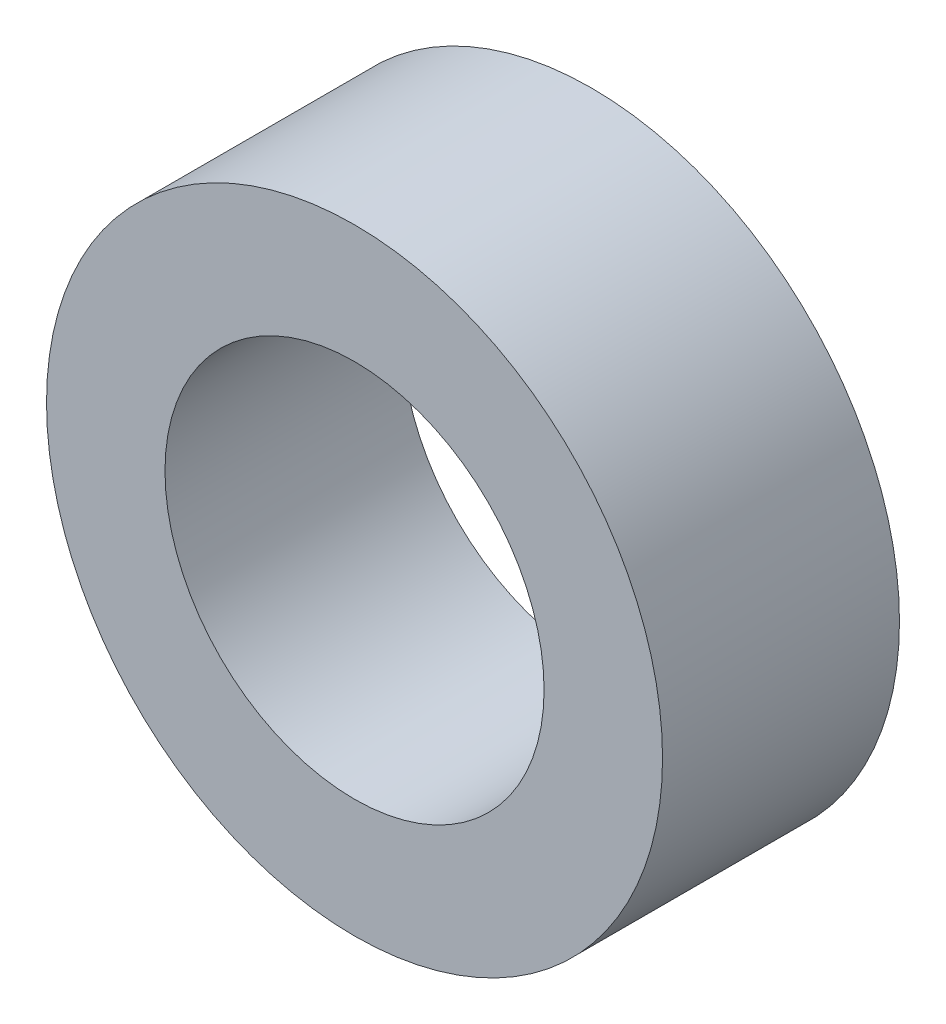
ISO-10303-21;
HEADER;
FILE_DESCRIPTION(('STEP AP214'),'2;1');
FILE_NAME('part.step','',(''),(''),'','','');
FILE_SCHEMA(('AUTOMOTIVE_DESIGN { 1 0 10303 214 1 1 1 1 }'));
ENDSEC;
DATA;
#1=APPLICATION_CONTEXT('core data for automotive mechanical design processes');
#2=APPLICATION_PROTOCOL_DEFINITION('international standard','automotive_design',2000,#1);
#3=PRODUCT_CONTEXT('',#1,'mechanical');
#4=PRODUCT('Part','Part','',(#3));
#5=PRODUCT_RELATED_PRODUCT_CATEGORY('part','',(#4));
#6=PRODUCT_DEFINITION_FORMATION('','',#4);
#7=PRODUCT_DEFINITION_CONTEXT('part definition',#1,'design');
#8=PRODUCT_DEFINITION('design','',#6,#7);
#9=PRODUCT_DEFINITION_SHAPE('','',#8);
#10=(LENGTH_UNIT() NAMED_UNIT(*) SI_UNIT(.MILLI.,.METRE.));
#11=(NAMED_UNIT(*) PLANE_ANGLE_UNIT() SI_UNIT($,.RADIAN.));
#12=(NAMED_UNIT(*) SI_UNIT($,.STERADIAN.) SOLID_ANGLE_UNIT());
#13=UNCERTAINTY_MEASURE_WITH_UNIT(LENGTH_MEASURE(1.E-05),#10,'distance_accuracy_value','');
#14=(GEOMETRIC_REPRESENTATION_CONTEXT(3) GLOBAL_UNCERTAINTY_ASSIGNED_CONTEXT((#13)) GLOBAL_UNIT_ASSIGNED_CONTEXT((#10,
#11,#12)) REPRESENTATION_CONTEXT('',''));
#15=CARTESIAN_POINT('',(0.,0.,0.));
#16=DIRECTION('',(0.,0.,1.));
#17=DIRECTION('',(1.,0.,0.));
#18=AXIS2_PLACEMENT_3D('',#15,#16,#17);
#19=CARTESIAN_POINT('',(0.,0.,5.));
#20=DIRECTION('',(0.,0.,1.));
#21=DIRECTION('',(1.,0.,0.));
#22=AXIS2_PLACEMENT_3D('',#19,#20,#21);
#23=PLANE('',#22);
#24=CARTESIAN_POINT('',(0.,0.,5.));
#25=DIRECTION('',(0.,0.,1.));
#26=DIRECTION('',(1.,0.,0.));
#27=AXIS2_PLACEMENT_3D('',#24,#25,#26);
#28=CIRCLE('',#27,6.5);
#29=CARTESIAN_POINT('',(6.5,0.,5.));
#30=VERTEX_POINT('',#29);
#31=EDGE_CURVE('E10',#30,#30,#28,.T.);
#32=ORIENTED_EDGE('',*,*,#31,.T.);
#33=EDGE_LOOP('',(#32));
#34=FACE_BOUND('',#33,.T.);
#35=CARTESIAN_POINT('',(0.,0.,5.));
#36=DIRECTION('',(0.,0.,1.));
#37=DIRECTION('',(1.,0.,0.));
#38=AXIS2_PLACEMENT_3D('',#35,#36,#37);
#39=CIRCLE('',#38,4.);
#40=CARTESIAN_POINT('',(4.,0.,5.));
#41=VERTEX_POINT('',#40);
#42=EDGE_CURVE('E47',#41,#41,#39,.T.);
#43=ORIENTED_EDGE('',*,*,#42,.F.);
#44=EDGE_LOOP('',(#43));
#45=FACE_BOUND('',#44,.T.);
#46=ADVANCED_FACE('F36',(#34,#45),#23,.T.);
#47=CARTESIAN_POINT('',(0.,0.,0.));
#48=DIRECTION('',(0.,0.,1.));
#49=DIRECTION('',(1.,0.,0.));
#50=AXIS2_PLACEMENT_3D('',#47,#48,#49);
#51=PLANE('',#50);
#52=CARTESIAN_POINT('',(0.,0.,0.));
#53=DIRECTION('',(0.,0.,1.));
#54=DIRECTION('',(1.,0.,0.));
#55=AXIS2_PLACEMENT_3D('',#52,#53,#54);
#56=CIRCLE('',#55,6.5);
#57=CARTESIAN_POINT('',(6.5,0.,0.));
#58=VERTEX_POINT('',#57);
#59=EDGE_CURVE('E40',#58,#58,#56,.T.);
#60=ORIENTED_EDGE('',*,*,#59,.F.);
#61=EDGE_LOOP('',(#60));
#62=FACE_BOUND('',#61,.T.);
#63=CARTESIAN_POINT('',(0.,0.,0.));
#64=DIRECTION('',(0.,0.,1.));
#65=DIRECTION('',(1.,0.,0.));
#66=AXIS2_PLACEMENT_3D('',#63,#64,#65);
#67=CIRCLE('',#66,4.);
#68=CARTESIAN_POINT('',(4.,0.,0.));
#69=VERTEX_POINT('',#68);
#70=EDGE_CURVE('E49',#69,#69,#67,.T.);
#71=ORIENTED_EDGE('',*,*,#70,.T.);
#72=EDGE_LOOP('',(#71));
#73=FACE_BOUND('',#72,.T.);
#74=ADVANCED_FACE('F59',(#62,#73),#51,.F.);
#75=CARTESIAN_POINT('',(0.,0.,5.));
#76=DIRECTION('',(0.,0.,-1.));
#77=DIRECTION('',(-1.,0.,0.));
#78=AXIS2_PLACEMENT_3D('',#75,#76,#77);
#79=CYLINDRICAL_SURFACE('',#78,6.5);
#80=ORIENTED_EDGE('',*,*,#31,.F.);
#81=EDGE_LOOP('',(#80));
#82=FACE_BOUND('',#81,.T.);
#83=ORIENTED_EDGE('',*,*,#59,.T.);
#84=EDGE_LOOP('',(#83));
#85=FACE_BOUND('',#84,.T.);
#86=ADVANCED_FACE('F38',(#82,#85),#79,.T.);
#87=CARTESIAN_POINT('',(0.,0.,5.));
#88=DIRECTION('',(0.,0.,-1.));
#89=DIRECTION('',(-1.,0.,0.));
#90=AXIS2_PLACEMENT_3D('',#87,#88,#89);
#91=CYLINDRICAL_SURFACE('',#90,4.);
#92=ORIENTED_EDGE('',*,*,#42,.T.);
#93=EDGE_LOOP('',(#92));
#94=FACE_BOUND('',#93,.T.);
#95=ORIENTED_EDGE('',*,*,#70,.F.);
#96=EDGE_LOOP('',(#95));
#97=FACE_BOUND('',#96,.T.);
#98=ADVANCED_FACE('F55',(#94,#97),#91,.F.);
#99=CLOSED_SHELL('',(#46,#74,#86,#98));
#100=MANIFOLD_SOLID_BREP('B2',#99);
#101=ADVANCED_BREP_SHAPE_REPRESENTATION('',(#18,#100),#14);
#102=SHAPE_DEFINITION_REPRESENTATION(#9,#101);
ENDSEC;
END-ISO-10303-21;
